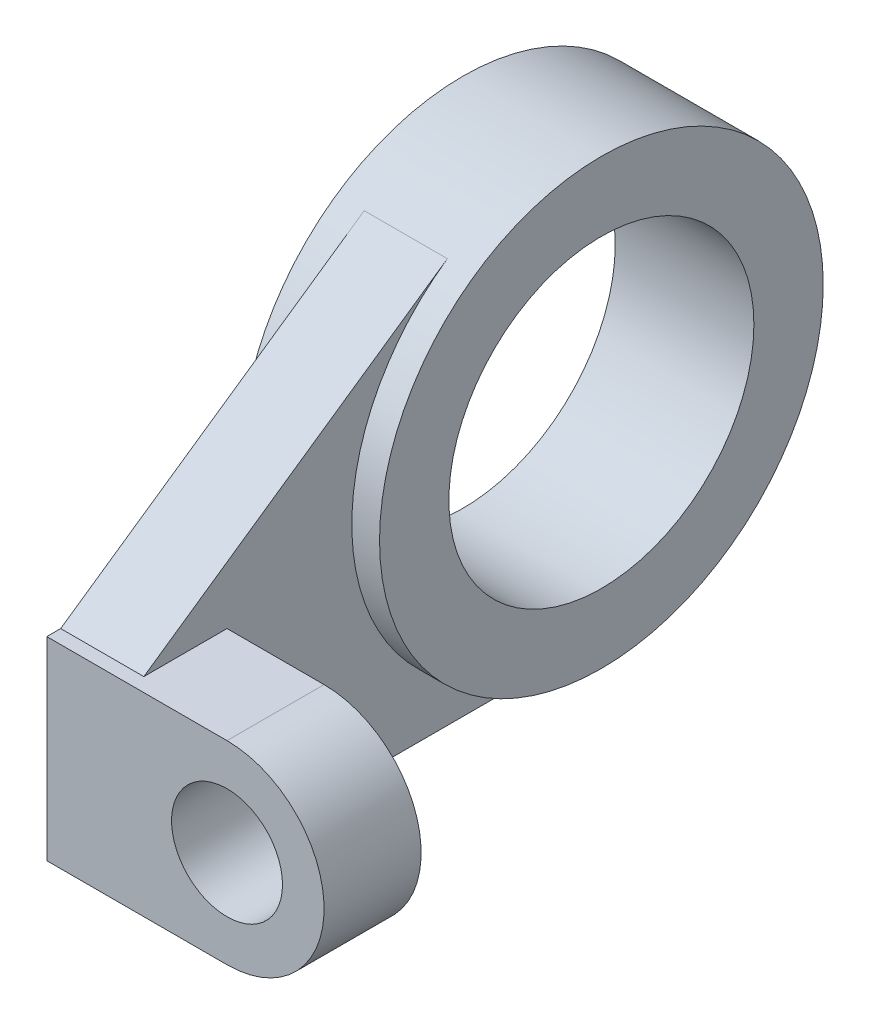
ISO-10303-21;
HEADER;
FILE_DESCRIPTION(('STEP AP214'),'2;1');
FILE_NAME('part.step','',(''),(''),'','','');
FILE_SCHEMA(('AUTOMOTIVE_DESIGN { 1 0 10303 214 1 1 1 1 }'));
ENDSEC;
DATA;
#1=APPLICATION_CONTEXT('core data for automotive mechanical design processes');
#2=APPLICATION_PROTOCOL_DEFINITION('international standard','automotive_design',2000,#1);
#3=PRODUCT_CONTEXT('',#1,'mechanical');
#4=PRODUCT('Part','Part','',(#3));
#5=PRODUCT_RELATED_PRODUCT_CATEGORY('part','',(#4));
#6=PRODUCT_DEFINITION_FORMATION('','',#4);
#7=PRODUCT_DEFINITION_CONTEXT('part definition',#1,'design');
#8=PRODUCT_DEFINITION('design','',#6,#7);
#9=PRODUCT_DEFINITION_SHAPE('','',#8);
#10=(LENGTH_UNIT() NAMED_UNIT(*) SI_UNIT(.MILLI.,.METRE.));
#11=(NAMED_UNIT(*) PLANE_ANGLE_UNIT() SI_UNIT($,.RADIAN.));
#12=(NAMED_UNIT(*) SI_UNIT($,.STERADIAN.) SOLID_ANGLE_UNIT());
#13=UNCERTAINTY_MEASURE_WITH_UNIT(LENGTH_MEASURE(1.E-05),#10,'distance_accuracy_value','');
#14=(GEOMETRIC_REPRESENTATION_CONTEXT(3) GLOBAL_UNCERTAINTY_ASSIGNED_CONTEXT((#13)) GLOBAL_UNIT_ASSIGNED_CONTEXT((#10,
#11,#12)) REPRESENTATION_CONTEXT('',''));
#15=CARTESIAN_POINT('',(0.,0.,0.));
#16=DIRECTION('',(0.,0.,1.));
#17=DIRECTION('',(1.,0.,0.));
#18=AXIS2_PLACEMENT_3D('',#15,#16,#17);
#19=CARTESIAN_POINT('',(9.525,0.,101.6));
#20=DIRECTION('',(0.,0.,1.));
#21=DIRECTION('',(1.,0.,0.));
#22=AXIS2_PLACEMENT_3D('',#19,#20,#21);
#23=PLANE('',#22);
#24=CARTESIAN_POINT('',(31.75,-28.575,101.6));
#25=DIRECTION('',(0.,0.,1.));
#26=DIRECTION('',(1.,0.,0.));
#27=AXIS2_PLACEMENT_3D('',#24,#25,#26);
#28=CIRCLE('',#27,12.7);
#29=CARTESIAN_POINT('',(44.45,-28.575,101.6));
#30=VERTEX_POINT('',#29);
#31=EDGE_CURVE('E133',#30,#30,#28,.T.);
#32=ORIENTED_EDGE('',*,*,#31,.F.);
#33=EDGE_LOOP('',(#32));
#34=FACE_BOUND('',#33,.T.);
#35=DIRECTION('',(-1.,0.,0.));
#36=VECTOR('',#35,1.);
#37=CARTESIAN_POINT('',(9.525,-50.8,101.6));
#38=LINE('',#37,#36);
#39=CARTESIAN_POINT('',(31.75,-50.8,101.6));
#40=VERTEX_POINT('',#39);
#41=CARTESIAN_POINT('',(-9.525,-50.8,101.6));
#42=VERTEX_POINT('',#41);
#43=EDGE_CURVE('E103',#40,#42,#38,.T.);
#44=ORIENTED_EDGE('',*,*,#43,.F.);
#45=CARTESIAN_POINT('',(31.75,-28.575,101.6));
#46=DIRECTION('',(0.,0.,1.));
#47=DIRECTION('',(1.,0.,0.));
#48=AXIS2_PLACEMENT_3D('',#45,#46,#47);
#49=CIRCLE('',#48,22.225);
#50=CARTESIAN_POINT('',(31.75,-6.35000000000002,101.6));
#51=VERTEX_POINT('',#50);
#52=EDGE_CURVE('E99',#40,#51,#49,.T.);
#53=ORIENTED_EDGE('',*,*,#52,.T.);
#54=DIRECTION('',(-1.,0.,0.));
#55=VECTOR('',#54,1.);
#56=CARTESIAN_POINT('',(9.525,-6.35000000000002,101.6));
#57=LINE('',#56,#55);
#58=CARTESIAN_POINT('',(-9.525,-6.35000000000002,101.6));
#59=VERTEX_POINT('',#58);
#60=EDGE_CURVE('E92',#51,#59,#57,.T.);
#61=ORIENTED_EDGE('',*,*,#60,.T.);
#62=DIRECTION('',(0.,1.,0.));
#63=VECTOR('',#62,1.);
#64=CARTESIAN_POINT('',(-9.525,0.,101.6));
#65=LINE('',#64,#63);
#66=EDGE_CURVE('E96',#42,#59,#65,.T.);
#67=ORIENTED_EDGE('',*,*,#66,.F.);
#68=EDGE_LOOP('',(#44,#53,#61,#67));
#69=FACE_BOUND('',#68,.T.);
#70=ADVANCED_FACE('F50',(#34,#69),#23,.T.);
#71=CARTESIAN_POINT('',(9.525,-50.8,0.));
#72=DIRECTION('',(0.,-1.,0.));
#73=DIRECTION('',(0.,0.,-1.));
#74=AXIS2_PLACEMENT_3D('',#71,#72,#73);
#75=PLANE('',#74);
#76=DIRECTION('',(-1.,0.,0.));
#77=VECTOR('',#76,1.);
#78=CARTESIAN_POINT('',(60.325,-50.8,79.375));
#79=LINE('',#78,#77);
#80=CARTESIAN_POINT('',(31.75,-50.8,79.375));
#81=VERTEX_POINT('',#80);
#82=CARTESIAN_POINT('',(9.525,-50.8,79.375));
#83=VERTEX_POINT('',#82);
#84=EDGE_CURVE('E152',#81,#83,#79,.T.);
#85=ORIENTED_EDGE('',*,*,#84,.F.);
#86=DIRECTION('',(0.,0.,1.));
#87=VECTOR('',#86,1.);
#88=CARTESIAN_POINT('',(31.75,-50.8,-50.8));
#89=LINE('',#88,#87);
#90=EDGE_CURVE('E64',#81,#40,#89,.T.);
#91=ORIENTED_EDGE('',*,*,#90,.T.);
#92=ORIENTED_EDGE('',*,*,#43,.T.);
#93=DIRECTION('',(0.,0.,1.));
#94=VECTOR('',#93,1.);
#95=CARTESIAN_POINT('',(-9.525,-50.8,0.));
#96=LINE('',#95,#94);
#97=CARTESIAN_POINT('',(-9.525,-50.8,0.));
#98=VERTEX_POINT('',#97);
#99=EDGE_CURVE('E117',#98,#42,#96,.T.);
#100=ORIENTED_EDGE('',*,*,#99,.F.);
#101=DIRECTION('',(-1.,0.,0.));
#102=VECTOR('',#101,1.);
#103=CARTESIAN_POINT('',(9.525,-50.8,0.));
#104=LINE('',#103,#102);
#105=CARTESIAN_POINT('',(9.525,-50.8,0.));
#106=VERTEX_POINT('',#105);
#107=EDGE_CURVE('E73',#106,#98,#104,.T.);
#108=ORIENTED_EDGE('',*,*,#107,.F.);
#109=DIRECTION('',(0.,0.,1.));
#110=VECTOR('',#109,1.);
#111=CARTESIAN_POINT('',(9.525,-50.8,0.));
#112=LINE('',#111,#110);
#113=EDGE_CURVE('E124',#106,#83,#112,.T.);
#114=ORIENTED_EDGE('',*,*,#113,.T.);
#115=EDGE_LOOP('',(#85,#91,#92,#100,#108,#114));
#116=FACE_BOUND('',#115,.T.);
#117=ADVANCED_FACE('F188',(#116),#75,.T.);
#118=CARTESIAN_POINT('',(60.325,-50.8,79.375));
#119=DIRECTION('',(0.,0.,1.));
#120=DIRECTION('',(1.,0.,0.));
#121=AXIS2_PLACEMENT_3D('',#118,#119,#120);
#122=PLANE('',#121);
#123=CARTESIAN_POINT('',(31.75,-28.575,79.375));
#124=DIRECTION('',(0.,0.,1.));
#125=DIRECTION('',(1.,0.,0.));
#126=AXIS2_PLACEMENT_3D('',#123,#124,#125);
#127=CIRCLE('',#126,12.7);
#128=CARTESIAN_POINT('',(44.45,-28.575,79.375));
#129=VERTEX_POINT('',#128);
#130=EDGE_CURVE('E130',#129,#129,#127,.T.);
#131=ORIENTED_EDGE('',*,*,#130,.T.);
#132=EDGE_LOOP('',(#131));
#133=FACE_BOUND('',#132,.T.);
#134=CARTESIAN_POINT('',(31.75,-28.575,79.375));
#135=DIRECTION('',(0.,0.,1.));
#136=DIRECTION('',(1.,0.,0.));
#137=AXIS2_PLACEMENT_3D('',#134,#135,#136);
#138=CIRCLE('',#137,22.225);
#139=CARTESIAN_POINT('',(31.75,-6.35000000000002,79.375));
#140=VERTEX_POINT('',#139);
#141=EDGE_CURVE('E12',#81,#140,#138,.T.);
#142=ORIENTED_EDGE('',*,*,#141,.F.);
#143=ORIENTED_EDGE('',*,*,#84,.T.);
#144=DIRECTION('',(0.,1.,0.));
#145=VECTOR('',#144,1.);
#146=CARTESIAN_POINT('',(9.525,-50.8,79.375));
#147=LINE('',#146,#145);
#148=CARTESIAN_POINT('',(9.525,-6.35000000000002,79.375));
#149=VERTEX_POINT('',#148);
#150=EDGE_CURVE('E132',#83,#149,#147,.T.);
#151=ORIENTED_EDGE('',*,*,#150,.T.);
#152=DIRECTION('',(-1.,0.,0.));
#153=VECTOR('',#152,1.);
#154=CARTESIAN_POINT('',(60.325,-6.35000000000002,79.375));
#155=LINE('',#154,#153);
#156=EDGE_CURVE('E149',#140,#149,#155,.T.);
#157=ORIENTED_EDGE('',*,*,#156,.F.);
#158=EDGE_LOOP('',(#142,#143,#151,#157));
#159=FACE_BOUND('',#158,.T.);
#160=ADVANCED_FACE('F198',(#133,#159),#122,.F.);
#161=CARTESIAN_POINT('',(9.525,0.,0.));
#162=DIRECTION('',(1.,0.,0.));
#163=DIRECTION('',(0.,0.,-1.));
#164=AXIS2_PLACEMENT_3D('',#161,#162,#163);
#165=PLANE('',#164);
#166=DIRECTION('',(0.,0.,1.));
#167=VECTOR('',#166,1.);
#168=CARTESIAN_POINT('',(9.525,-6.35000000000002,101.6));
#169=LINE('',#168,#167);
#170=CARTESIAN_POINT('',(9.525,-6.35000000000002,98.425));
#171=VERTEX_POINT('',#170);
#172=EDGE_CURVE('E137',#149,#171,#169,.T.);
#173=ORIENTED_EDGE('',*,*,#172,.F.);
#174=ORIENTED_EDGE('',*,*,#150,.F.);
#175=ORIENTED_EDGE('',*,*,#113,.F.);
#176=CARTESIAN_POINT('',(9.525,0.,0.));
#177=DIRECTION('',(1.,0.,0.));
#178=DIRECTION('',(0.,0.,-1.));
#179=AXIS2_PLACEMENT_3D('',#176,#177,#178);
#180=CIRCLE('',#179,50.8);
#181=CARTESIAN_POINT('',(9.525,41.7685849737357,28.9141022563701));
#182=VERTEX_POINT('',#181);
#183=EDGE_CURVE('E163',#106,#182,#180,.F.);
#184=ORIENTED_EDGE('',*,*,#183,.T.);
#185=DIRECTION('',(0.,0.569175241267127,-0.822216239640466));
#186=VECTOR('',#185,1.);
#187=CARTESIAN_POINT('',(9.525,41.7685849737357,28.9141022563701));
#188=LINE('',#187,#186);
#189=EDGE_CURVE('E119',#171,#182,#188,.T.);
#190=ORIENTED_EDGE('',*,*,#189,.F.);
#191=EDGE_LOOP('',(#173,#174,#175,#184,#190));
#192=FACE_BOUND('',#191,.T.);
#193=ADVANCED_FACE('F184',(#192),#165,.T.);
#194=CARTESIAN_POINT('',(-9.525,0.,0.));
#195=DIRECTION('',(1.,0.,0.));
#196=DIRECTION('',(0.,0.,-1.));
#197=AXIS2_PLACEMENT_3D('',#194,#195,#196);
#198=PLANE('',#197);
#199=CARTESIAN_POINT('',(-9.525,0.,0.));
#200=DIRECTION('',(1.,0.,0.));
#201=DIRECTION('',(0.,0.,-1.));
#202=AXIS2_PLACEMENT_3D('',#199,#200,#201);
#203=CIRCLE('',#202,50.8);
#204=CARTESIAN_POINT('',(-9.525,41.7685849737357,28.91410225637));
#205=VERTEX_POINT('',#204);
#206=EDGE_CURVE('E58',#98,#205,#203,.F.);
#207=ORIENTED_EDGE('',*,*,#206,.F.);
#208=ORIENTED_EDGE('',*,*,#99,.T.);
#209=ORIENTED_EDGE('',*,*,#66,.T.);
#210=DIRECTION('',(0.,0.,-1.));
#211=VECTOR('',#210,1.);
#212=CARTESIAN_POINT('',(-9.525,-6.35000000000002,0.));
#213=LINE('',#212,#211);
#214=CARTESIAN_POINT('',(-9.525,-6.35000000000002,98.425));
#215=VERTEX_POINT('',#214);
#216=EDGE_CURVE('E106',#59,#215,#213,.T.);
#217=ORIENTED_EDGE('',*,*,#216,.T.);
#218=DIRECTION('',(0.,0.569175241267127,-0.822216239640466));
#219=VECTOR('',#218,1.);
#220=CARTESIAN_POINT('',(-9.525,41.7685849737357,28.9141022563701));
#221=LINE('',#220,#219);
#222=EDGE_CURVE('E113',#215,#205,#221,.T.);
#223=ORIENTED_EDGE('',*,*,#222,.T.);
#224=EDGE_LOOP('',(#207,#208,#209,#217,#223));
#225=FACE_BOUND('',#224,.T.);
#226=ADVANCED_FACE('F116',(#225),#198,.F.);
#227=CARTESIAN_POINT('',(9.525,0.,0.));
#228=DIRECTION('',(-1.,0.,0.));
#229=DIRECTION('',(0.,0.,1.));
#230=AXIS2_PLACEMENT_3D('',#227,#228,#229);
#231=CYLINDRICAL_SURFACE('',#230,50.8);
#232=ORIENTED_EDGE('',*,*,#107,.T.);
#233=ORIENTED_EDGE('',*,*,#206,.T.);
#234=DIRECTION('',(-1.,0.,0.));
#235=VECTOR('',#234,1.);
#236=CARTESIAN_POINT('',(9.525,41.7685849737357,28.91410225637));
#237=LINE('',#236,#235);
#238=EDGE_CURVE('E127',#182,#205,#237,.T.);
#239=ORIENTED_EDGE('',*,*,#238,.F.);
#240=ORIENTED_EDGE('',*,*,#183,.F.);
#241=EDGE_LOOP('',(#232,#233,#239,#240));
#242=FACE_BOUND('',#241,.T.);
#243=CARTESIAN_POINT('',(-15.875,0.,0.));
#244=DIRECTION('',(1.,0.,0.));
#245=DIRECTION('',(0.,0.,-1.));
#246=AXIS2_PLACEMENT_3D('',#243,#244,#245);
#247=CIRCLE('',#246,50.8);
#248=CARTESIAN_POINT('',(-15.875,0.,-50.8));
#249=VERTEX_POINT('',#248);
#250=EDGE_CURVE('E160',#249,#249,#247,.T.);
#251=ORIENTED_EDGE('',*,*,#250,.T.);
#252=EDGE_LOOP('',(#251));
#253=FACE_BOUND('',#252,.T.);
#254=CARTESIAN_POINT('',(15.875,0.,0.));
#255=DIRECTION('',(1.,0.,0.));
#256=DIRECTION('',(0.,0.,-1.));
#257=AXIS2_PLACEMENT_3D('',#254,#255,#256);
#258=CIRCLE('',#257,50.8);
#259=CARTESIAN_POINT('',(15.875,0.,-50.8));
#260=VERTEX_POINT('',#259);
#261=EDGE_CURVE('E159',#260,#260,#258,.T.);
#262=ORIENTED_EDGE('',*,*,#261,.F.);
#263=EDGE_LOOP('',(#262));
#264=FACE_BOUND('',#263,.T.);
#265=ADVANCED_FACE('F180',(#242,#253,#264),#231,.T.);
#266=CARTESIAN_POINT('',(9.525,41.7685849737357,28.9141022563701));
#267=DIRECTION('',(0.,0.822216239640466,0.569175241267127));
#268=DIRECTION('',(0.,-0.569175241267127,0.822216239640466));
#269=AXIS2_PLACEMENT_3D('',#266,#267,#268);
#270=PLANE('',#269);
#271=ORIENTED_EDGE('',*,*,#222,.F.);
#272=DIRECTION('',(-1.,0.,0.));
#273=VECTOR('',#272,1.);
#274=CARTESIAN_POINT('',(9.525,-6.35000000000002,98.425));
#275=LINE('',#274,#273);
#276=EDGE_CURVE('E102',#171,#215,#275,.T.);
#277=ORIENTED_EDGE('',*,*,#276,.F.);
#278=ORIENTED_EDGE('',*,*,#189,.T.);
#279=ORIENTED_EDGE('',*,*,#238,.T.);
#280=EDGE_LOOP('',(#271,#277,#278,#279));
#281=FACE_BOUND('',#280,.T.);
#282=ADVANCED_FACE('F174',(#281),#270,.T.);
#283=CARTESIAN_POINT('',(9.525,-6.35000000000002,0.));
#284=DIRECTION('',(0.,1.,0.));
#285=DIRECTION('',(0.,0.,1.));
#286=AXIS2_PLACEMENT_3D('',#283,#284,#285);
#287=PLANE('',#286);
#288=DIRECTION('',(0.,0.,1.));
#289=VECTOR('',#288,1.);
#290=CARTESIAN_POINT('',(31.75,-6.35000000000002,-50.8));
#291=LINE('',#290,#289);
#292=EDGE_CURVE('E140',#140,#51,#291,.T.);
#293=ORIENTED_EDGE('',*,*,#292,.F.);
#294=ORIENTED_EDGE('',*,*,#156,.T.);
#295=ORIENTED_EDGE('',*,*,#172,.T.);
#296=ORIENTED_EDGE('',*,*,#276,.T.);
#297=ORIENTED_EDGE('',*,*,#216,.F.);
#298=ORIENTED_EDGE('',*,*,#60,.F.);
#299=EDGE_LOOP('',(#293,#294,#295,#296,#297,#298));
#300=FACE_BOUND('',#299,.T.);
#301=ADVANCED_FACE('F107',(#300),#287,.T.);
#302=CARTESIAN_POINT('',(-15.875,0.,0.));
#303=DIRECTION('',(1.,0.,0.));
#304=DIRECTION('',(0.,0.,-1.));
#305=AXIS2_PLACEMENT_3D('',#302,#303,#304);
#306=PLANE('',#305);
#307=CARTESIAN_POINT('',(-15.875,0.,0.));
#308=DIRECTION('',(1.,0.,0.));
#309=DIRECTION('',(0.,0.,-1.));
#310=AXIS2_PLACEMENT_3D('',#307,#308,#309);
#311=CIRCLE('',#310,34.925);
#312=CARTESIAN_POINT('',(-15.875,0.,-34.925));
#313=VERTEX_POINT('',#312);
#314=EDGE_CURVE('E155',#313,#313,#311,.T.);
#315=ORIENTED_EDGE('',*,*,#314,.T.);
#316=EDGE_LOOP('',(#315));
#317=FACE_BOUND('',#316,.T.);
#318=ORIENTED_EDGE('',*,*,#250,.F.);
#319=EDGE_LOOP('',(#318));
#320=FACE_BOUND('',#319,.T.);
#321=ADVANCED_FACE('F218',(#317,#320),#306,.F.);
#322=CARTESIAN_POINT('',(9.525,0.,0.));
#323=DIRECTION('',(-1.,0.,0.));
#324=DIRECTION('',(0.,0.,1.));
#325=AXIS2_PLACEMENT_3D('',#322,#323,#324);
#326=CYLINDRICAL_SURFACE('',#325,34.925);
#327=ORIENTED_EDGE('',*,*,#314,.F.);
#328=EDGE_LOOP('',(#327));
#329=FACE_BOUND('',#328,.T.);
#330=CARTESIAN_POINT('',(15.875,0.,0.));
#331=DIRECTION('',(1.,0.,0.));
#332=DIRECTION('',(0.,0.,-1.));
#333=AXIS2_PLACEMENT_3D('',#330,#331,#332);
#334=CIRCLE('',#333,34.925);
#335=CARTESIAN_POINT('',(15.875,0.,-34.925));
#336=VERTEX_POINT('',#335);
#337=EDGE_CURVE('E156',#336,#336,#334,.T.);
#338=ORIENTED_EDGE('',*,*,#337,.T.);
#339=EDGE_LOOP('',(#338));
#340=FACE_BOUND('',#339,.T.);
#341=ADVANCED_FACE('F52',(#329,#340),#326,.F.);
#342=CARTESIAN_POINT('',(15.875,0.,0.));
#343=DIRECTION('',(1.,0.,0.));
#344=DIRECTION('',(0.,0.,-1.));
#345=AXIS2_PLACEMENT_3D('',#342,#343,#344);
#346=PLANE('',#345);
#347=ORIENTED_EDGE('',*,*,#337,.F.);
#348=EDGE_LOOP('',(#347));
#349=FACE_BOUND('',#348,.T.);
#350=ORIENTED_EDGE('',*,*,#261,.T.);
#351=EDGE_LOOP('',(#350));
#352=FACE_BOUND('',#351,.T.);
#353=ADVANCED_FACE('F229',(#349,#352),#346,.T.);
#354=CARTESIAN_POINT('',(31.75,-28.575,-50.8));
#355=DIRECTION('',(0.,0.,1.));
#356=DIRECTION('',(1.,0.,0.));
#357=AXIS2_PLACEMENT_3D('',#354,#355,#356);
#358=CYLINDRICAL_SURFACE('',#357,12.7);
#359=ORIENTED_EDGE('',*,*,#31,.T.);
#360=EDGE_LOOP('',(#359));
#361=FACE_BOUND('',#360,.T.);
#362=ORIENTED_EDGE('',*,*,#130,.F.);
#363=EDGE_LOOP('',(#362));
#364=FACE_BOUND('',#363,.T.);
#365=ADVANCED_FACE('F231',(#361,#364),#358,.F.);
#366=CARTESIAN_POINT('',(31.75,-28.575,-50.8));
#367=DIRECTION('',(0.,0.,1.));
#368=DIRECTION('',(1.,0.,0.));
#369=AXIS2_PLACEMENT_3D('',#366,#367,#368);
#370=CYLINDRICAL_SURFACE('',#369,22.225);
#371=ORIENTED_EDGE('',*,*,#141,.T.);
#372=ORIENTED_EDGE('',*,*,#292,.T.);
#373=ORIENTED_EDGE('',*,*,#52,.F.);
#374=ORIENTED_EDGE('',*,*,#90,.F.);
#375=EDGE_LOOP('',(#371,#372,#373,#374));
#376=FACE_BOUND('',#375,.T.);
#377=ADVANCED_FACE('F237',(#376),#370,.T.);
#378=CLOSED_SHELL('',(#70,#117,#160,#193,#226,#265,#282,#301,#321,#341,#353,#365,#377));
#379=MANIFOLD_SOLID_BREP('B2',#378);
#380=ADVANCED_BREP_SHAPE_REPRESENTATION('',(#18,#379),#14);
#381=SHAPE_DEFINITION_REPRESENTATION(#9,#380);
ENDSEC;
END-ISO-10303-21;
